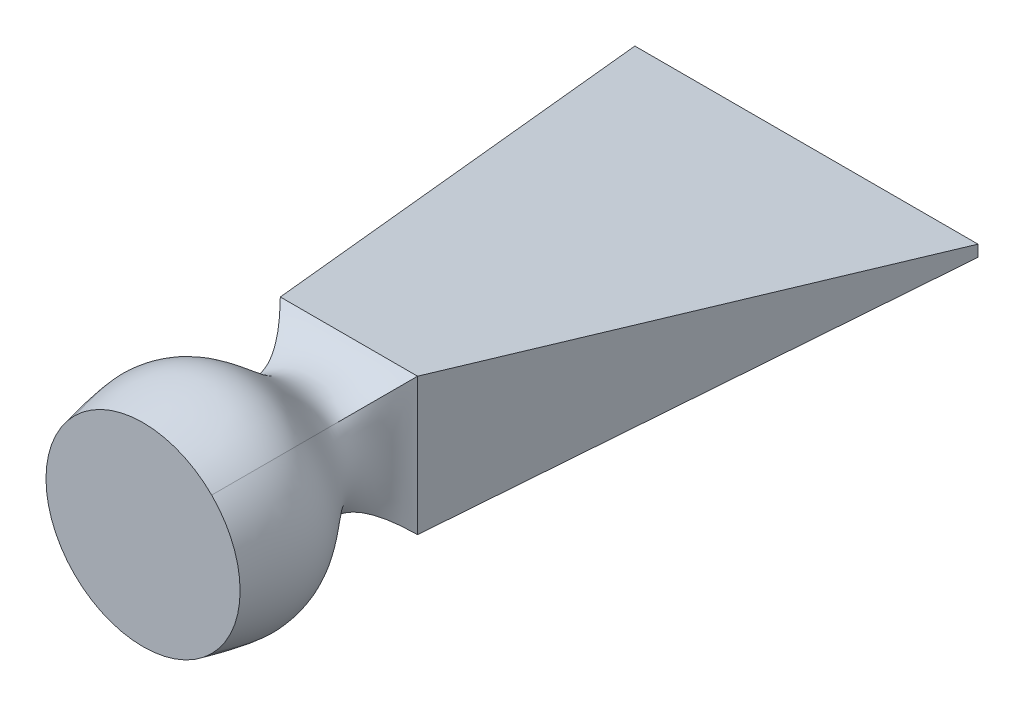
ISO-10303-21;
HEADER;
FILE_DESCRIPTION(('STEP AP214'),'2;1');
FILE_NAME('part.step','',(''),(''),'','','');
FILE_SCHEMA(('AUTOMOTIVE_DESIGN { 1 0 10303 214 1 1 1 1 }'));
ENDSEC;
DATA;
#1=APPLICATION_CONTEXT('core data for automotive mechanical design processes');
#2=APPLICATION_PROTOCOL_DEFINITION('international standard','automotive_design',2000,#1);
#3=PRODUCT_CONTEXT('',#1,'mechanical');
#4=PRODUCT('Part','Part','',(#3));
#5=PRODUCT_RELATED_PRODUCT_CATEGORY('part','',(#4));
#6=PRODUCT_DEFINITION_FORMATION('','',#4);
#7=PRODUCT_DEFINITION_CONTEXT('part definition',#1,'design');
#8=PRODUCT_DEFINITION('design','',#6,#7);
#9=PRODUCT_DEFINITION_SHAPE('','',#8);
#10=(LENGTH_UNIT() NAMED_UNIT(*) SI_UNIT(.MILLI.,.METRE.));
#11=(NAMED_UNIT(*) PLANE_ANGLE_UNIT() SI_UNIT($,.RADIAN.));
#12=(NAMED_UNIT(*) SI_UNIT($,.STERADIAN.) SOLID_ANGLE_UNIT());
#13=UNCERTAINTY_MEASURE_WITH_UNIT(LENGTH_MEASURE(1.E-05),#10,'distance_accuracy_value','');
#14=(GEOMETRIC_REPRESENTATION_CONTEXT(3) GLOBAL_UNCERTAINTY_ASSIGNED_CONTEXT((#13)) GLOBAL_UNIT_ASSIGNED_CONTEXT((#10,
#11,#12)) REPRESENTATION_CONTEXT('',''));
#15=CARTESIAN_POINT('',(0.,0.,0.));
#16=DIRECTION('',(0.,0.,1.));
#17=DIRECTION('',(1.,0.,0.));
#18=AXIS2_PLACEMENT_3D('',#15,#16,#17);
#19=CARTESIAN_POINT('',(0.,0.,90.));
#20=DIRECTION('',(0.,0.,1.));
#21=DIRECTION('',(1.,0.,0.));
#22=AXIS2_PLACEMENT_3D('',#19,#20,#21);
#23=PLANE('',#22);
#24=CARTESIAN_POINT('',(0.,0.,90.));
#25=DIRECTION('',(0.,0.,1.));
#26=DIRECTION('',(1.,0.,0.));
#27=AXIS2_PLACEMENT_3D('',#24,#25,#26);
#28=CIRCLE('',#27,42.4264068711929);
#29=CARTESIAN_POINT('',(-30.,30.,90.));
#30=VERTEX_POINT('',#29);
#31=CARTESIAN_POINT('',(-30.,-30.,90.));
#32=VERTEX_POINT('',#31);
#33=EDGE_CURVE('E114',#30,#32,#28,.T.);
#34=ORIENTED_EDGE('',*,*,#33,.T.);
#35=CARTESIAN_POINT('',(30.,-30.,90.));
#36=VERTEX_POINT('',#35);
#37=EDGE_CURVE('E106',#32,#36,#28,.T.);
#38=ORIENTED_EDGE('',*,*,#37,.T.);
#39=CARTESIAN_POINT('',(30.,30.,90.));
#40=VERTEX_POINT('',#39);
#41=EDGE_CURVE('E110',#36,#40,#28,.T.);
#42=ORIENTED_EDGE('',*,*,#41,.T.);
#43=EDGE_CURVE('E134',#40,#30,#28,.T.);
#44=ORIENTED_EDGE('',*,*,#43,.T.);
#45=EDGE_LOOP('',(#34,#38,#42,#44));
#46=FACE_BOUND('',#45,.T.);
#47=ADVANCED_FACE('F71',(#46),#23,.T.);
#48=CARTESIAN_POINT('',(30.,30.,0.));
#49=CARTESIAN_POINT('',(21.7851130197758,21.7851130197758,8.33333333333334));
#50=CARTESIAN_POINT('',(11.4480792780272,11.4480792780272,26.6842583231321));
#51=CARTESIAN_POINT('',(36.5877389212421,36.5877389212421,50.9567471285879));
#52=CARTESIAN_POINT('',(32.3581604097574,32.3581604097574,75.7725733783253));
#53=CARTESIAN_POINT('',(30.,30.,90.));
#54=CARTESIAN_POINT('',(10.,30.,0.));
#55=CARTESIAN_POINT('',(7.26170433992527,21.7851130197758,8.33333333333334));
#56=CARTESIAN_POINT('',(6.36969580298355,23.7303286113224,26.6842583231321));
#57=CARTESIAN_POINT('',(15.9903753094837,54.8377649087592,50.9567471285879));
#58=CARTESIAN_POINT('',(14.2286031722261,48.9156107074504,75.7725733783253));
#59=CARTESIAN_POINT('',(13.442549702307,46.557450297693,90.));
#60=CARTESIAN_POINT('',(-9.99999999999999,30.,0.));
#61=CARTESIAN_POINT('',(-7.26170433992526,21.7851130197758,8.33333333333334));
#62=CARTESIAN_POINT('',(-6.36969580298354,23.7303286113224,26.6842583231321));
#63=CARTESIAN_POINT('',(-15.9903753094837,54.8377649087592,50.9567471285879));
#64=CARTESIAN_POINT('',(-14.2286031722261,48.9156107074504,75.7725733783253));
#65=CARTESIAN_POINT('',(-13.442549702307,46.557450297693,90.));
#66=CARTESIAN_POINT('',(-30.,30.,0.));
#67=CARTESIAN_POINT('',(-21.7851130197758,21.7851130197758,8.33333333333334));
#68=CARTESIAN_POINT('',(-11.4480792780272,11.4480792780272,26.6842583231321));
#69=CARTESIAN_POINT('',(-36.5877389212421,36.5877389212421,50.9567471285879));
#70=CARTESIAN_POINT('',(-32.3581604097574,32.3581604097574,75.7725733783253));
#71=CARTESIAN_POINT('',(-30.,30.,90.));
#72=B_SPLINE_SURFACE_WITH_KNOTS('',3,3,((#48,#49,#50,#51,#52,#53),(#54,#55,#56,#57,#58,#59),
(#60,#61,#62,#63,#64,#65),(#66,#67,#68,#69,#70,#71)),.UNSPECIFIED.,.F.,.F.,.F.,(4,4),(4,1,1,4),
(0.,1.),(0.,0.284226887704337,0.593739185555325,1.),.UNSPECIFIED.);
#73=DIRECTION('',(-1.,0.,0.));
#74=VECTOR('',#73,1.);
#75=CARTESIAN_POINT('',(-30.,30.,0.));
#76=LINE('',#75,#74);
#77=CARTESIAN_POINT('',(30.,30.,0.));
#78=VERTEX_POINT('',#77);
#79=CARTESIAN_POINT('',(-30.,30.,0.));
#80=VERTEX_POINT('',#79);
#81=EDGE_CURVE('E319',#78,#80,#76,.T.);
#82=CARTESIAN_POINT('',(-30.,30.,0.));
#83=CARTESIAN_POINT('',(-21.7851130197758,21.7851130197758,8.33333333333334));
#84=CARTESIAN_POINT('',(-11.4480792780272,11.4480792780272,26.6842583231321));
#85=CARTESIAN_POINT('',(-36.5877389212421,36.5877389212421,50.9567471285879));
#86=CARTESIAN_POINT('',(-32.3581604097574,32.3581604097574,75.7725733783253));
#87=CARTESIAN_POINT('',(-30.,30.,90.));
#88=B_SPLINE_CURVE_WITH_KNOTS('',3,(#82,#83,#84,#85,#86,#87),.UNSPECIFIED.,.F.,.F.,(4,1,1,4),
(0.,0.284226887704337,0.593739185555325,1.),.UNSPECIFIED.);
#89=EDGE_CURVE('E156',#80,#30,#88,.T.);
#90=CARTESIAN_POINT('',(30.,30.,0.));
#91=CARTESIAN_POINT('',(21.7851130197758,21.7851130197758,8.33333333333334));
#92=CARTESIAN_POINT('',(11.4480792780272,11.4480792780272,26.6842583231321));
#93=CARTESIAN_POINT('',(36.5877389212421,36.5877389212421,50.9567471285879));
#94=CARTESIAN_POINT('',(32.3581604097574,32.3581604097574,75.7725733783253));
#95=CARTESIAN_POINT('',(30.,30.,90.));
#96=B_SPLINE_CURVE_WITH_KNOTS('',3,(#90,#91,#92,#93,#94,#95),.UNSPECIFIED.,.F.,.F.,(4,1,1,4),
(0.,0.284226887704337,0.593739185555325,1.),.UNSPECIFIED.);
#97=EDGE_CURVE('E133',#40,#78,#96,.F.);
#98=ORIENTED_EDGE('',*,*,#81,.T.);
#99=ORIENTED_EDGE('',*,*,#89,.T.);
#100=ORIENTED_EDGE('',*,*,#43,.F.);
#101=ORIENTED_EDGE('',*,*,#97,.T.);
#102=EDGE_LOOP('',(#98,#99,#100,#101));
#103=FACE_BOUND('',#102,.T.);
#104=ADVANCED_FACE('F179',(#103),#72,.T.);
#105=CARTESIAN_POINT('',(-30.,30.,0.));
#106=CARTESIAN_POINT('',(-21.7851130197758,21.7851130197758,8.33333333333334));
#107=CARTESIAN_POINT('',(-11.4480792780272,11.4480792780272,26.6842583231321));
#108=CARTESIAN_POINT('',(-36.5877389212421,36.5877389212421,50.9567471285879));
#109=CARTESIAN_POINT('',(-32.3581604097574,32.3581604097574,75.7725733783253));
#110=CARTESIAN_POINT('',(-30.,30.,90.));
#111=CARTESIAN_POINT('',(-30.,10.,0.));
#112=CARTESIAN_POINT('',(-21.7851130197758,7.26170433992526,8.33333333333334));
#113=CARTESIAN_POINT('',(-23.7303286113224,6.36969580298355,26.6842583231321));
#114=CARTESIAN_POINT('',(-54.8377649087592,15.9903753094837,50.9567471285879));
#115=CARTESIAN_POINT('',(-48.9156107074504,14.2286031722261,75.7725733783253));
#116=CARTESIAN_POINT('',(-46.557450297693,13.442549702307,90.));
#117=CARTESIAN_POINT('',(-30.,-10.,0.));
#118=CARTESIAN_POINT('',(-21.7851130197758,-7.26170433992526,8.33333333333334));
#119=CARTESIAN_POINT('',(-23.7303286113224,-6.36969580298354,26.6842583231321));
#120=CARTESIAN_POINT('',(-54.8377649087592,-15.9903753094837,50.9567471285879));
#121=CARTESIAN_POINT('',(-48.9156107074504,-14.2286031722261,75.7725733783253));
#122=CARTESIAN_POINT('',(-46.557450297693,-13.442549702307,90.));
#123=CARTESIAN_POINT('',(-30.,-30.,0.));
#124=CARTESIAN_POINT('',(-21.7851130197758,-21.7851130197758,8.33333333333334));
#125=CARTESIAN_POINT('',(-11.4480792780272,-11.4480792780272,26.6842583231321));
#126=CARTESIAN_POINT('',(-36.5877389212421,-36.5877389212421,50.9567471285879));
#127=CARTESIAN_POINT('',(-32.3581604097574,-32.3581604097574,75.7725733783253));
#128=CARTESIAN_POINT('',(-30.,-30.,90.));
#129=B_SPLINE_SURFACE_WITH_KNOTS('',3,3,((#105,#106,#107,#108,#109,#110),(#111,#112,#113,#114,
#115,#116),(#117,#118,#119,#120,#121,#122),(#123,#124,#125,#126,#127,#128)),.UNSPECIFIED.,.F.,
.F.,.F.,(4,4),(4,1,1,4),(0.,1.),(0.,0.284226887704337,0.593739185555325,1.),.UNSPECIFIED.);
#130=DIRECTION('',(0.,-1.,0.));
#131=VECTOR('',#130,1.);
#132=CARTESIAN_POINT('',(-30.,-30.,0.));
#133=LINE('',#132,#131);
#134=CARTESIAN_POINT('',(-30.,-30.,0.));
#135=VERTEX_POINT('',#134);
#136=EDGE_CURVE('E81',#80,#135,#133,.T.);
#137=CARTESIAN_POINT('',(-30.,-30.,0.));
#138=CARTESIAN_POINT('',(-21.7851130197758,-21.7851130197758,8.33333333333334));
#139=CARTESIAN_POINT('',(-11.4480792780272,-11.4480792780272,26.6842583231321));
#140=CARTESIAN_POINT('',(-36.5877389212421,-36.5877389212421,50.9567471285879));
#141=CARTESIAN_POINT('',(-32.3581604097574,-32.3581604097574,75.7725733783253));
#142=CARTESIAN_POINT('',(-30.,-30.,90.));
#143=B_SPLINE_CURVE_WITH_KNOTS('',3,(#137,#138,#139,#140,#141,#142),.UNSPECIFIED.,.F.,.F.,(4,1,
1,4),(0.,0.284226887704337,0.593739185555325,1.),.UNSPECIFIED.);
#144=EDGE_CURVE('E140',#135,#32,#143,.T.);
#145=ORIENTED_EDGE('',*,*,#136,.T.);
#146=ORIENTED_EDGE('',*,*,#144,.T.);
#147=ORIENTED_EDGE('',*,*,#33,.F.);
#148=ORIENTED_EDGE('',*,*,#89,.F.);
#149=EDGE_LOOP('',(#145,#146,#147,#148));
#150=FACE_BOUND('',#149,.T.);
#151=ADVANCED_FACE('F191',(#150),#129,.T.);
#152=CARTESIAN_POINT('',(30.,-30.,0.));
#153=CARTESIAN_POINT('',(21.7851130197758,-21.7851130197758,8.33333333333334));
#154=CARTESIAN_POINT('',(11.4480792780272,-11.4480792780272,26.6842583231321));
#155=CARTESIAN_POINT('',(36.5877389212421,-36.5877389212421,50.9567471285879));
#156=CARTESIAN_POINT('',(32.3581604097574,-32.3581604097574,75.7725733783253));
#157=CARTESIAN_POINT('',(30.,-30.,90.));
#158=CARTESIAN_POINT('',(30.,-10.,0.));
#159=CARTESIAN_POINT('',(21.7851130197758,-7.26170433992527,8.33333333333334));
#160=CARTESIAN_POINT('',(23.7303286113224,-6.36969580298356,26.6842583231321));
#161=CARTESIAN_POINT('',(54.8377649087593,-15.9903753094837,50.9567471285879));
#162=CARTESIAN_POINT('',(48.9156107074504,-14.2286031722261,75.7725733783253));
#163=CARTESIAN_POINT('',(46.557450297693,-13.442549702307,90.));
#164=CARTESIAN_POINT('',(30.,10.,0.));
#165=CARTESIAN_POINT('',(21.7851130197758,7.26170433992526,8.33333333333334));
#166=CARTESIAN_POINT('',(23.7303286113224,6.36969580298354,26.6842583231321));
#167=CARTESIAN_POINT('',(54.8377649087593,15.9903753094837,50.9567471285879));
#168=CARTESIAN_POINT('',(48.9156107074504,14.2286031722261,75.7725733783253));
#169=CARTESIAN_POINT('',(46.557450297693,13.442549702307,90.));
#170=CARTESIAN_POINT('',(30.,30.,0.));
#171=CARTESIAN_POINT('',(21.7851130197758,21.7851130197758,8.33333333333334));
#172=CARTESIAN_POINT('',(11.4480792780272,11.4480792780272,26.6842583231321));
#173=CARTESIAN_POINT('',(36.5877389212422,36.5877389212421,50.9567471285879));
#174=CARTESIAN_POINT('',(32.3581604097574,32.3581604097574,75.7725733783253));
#175=CARTESIAN_POINT('',(30.,30.,90.));
#176=B_SPLINE_SURFACE_WITH_KNOTS('',3,3,((#152,#153,#154,#155,#156,#157),(#158,#159,#160,#161,
#162,#163),(#164,#165,#166,#167,#168,#169),(#170,#171,#172,#173,#174,#175)),.UNSPECIFIED.,.F.,
.F.,.F.,(4,4),(4,1,1,4),(0.,1.),(0.,0.284226887704337,0.593739185555325,1.),.UNSPECIFIED.);
#177=DIRECTION('',(0.,1.,0.));
#178=VECTOR('',#177,1.);
#179=CARTESIAN_POINT('',(30.,-30.,0.));
#180=LINE('',#179,#178);
#181=CARTESIAN_POINT('',(30.,-30.,0.));
#182=VERTEX_POINT('',#181);
#183=EDGE_CURVE('E165',#182,#78,#180,.T.);
#184=CARTESIAN_POINT('',(30.,-30.,0.));
#185=CARTESIAN_POINT('',(21.7851130197758,-21.7851130197758,8.33333333333334));
#186=CARTESIAN_POINT('',(11.4480792780272,-11.4480792780272,26.6842583231321));
#187=CARTESIAN_POINT('',(36.5877389212421,-36.5877389212421,50.9567471285879));
#188=CARTESIAN_POINT('',(32.3581604097574,-32.3581604097574,75.7725733783253));
#189=CARTESIAN_POINT('',(30.,-30.,90.));
#190=B_SPLINE_CURVE_WITH_KNOTS('',3,(#184,#185,#186,#187,#188,#189),.UNSPECIFIED.,.F.,.F.,(4,1,
1,4),(0.,0.284226887704337,0.593739185555325,1.),.UNSPECIFIED.);
#191=EDGE_CURVE('E131',#182,#36,#190,.T.);
#192=ORIENTED_EDGE('',*,*,#183,.T.);
#193=ORIENTED_EDGE('',*,*,#97,.F.);
#194=ORIENTED_EDGE('',*,*,#41,.F.);
#195=ORIENTED_EDGE('',*,*,#191,.F.);
#196=EDGE_LOOP('',(#192,#193,#194,#195));
#197=FACE_BOUND('',#196,.T.);
#198=ADVANCED_FACE('F129',(#197),#176,.T.);
#199=CARTESIAN_POINT('',(-30.,-30.,0.));
#200=CARTESIAN_POINT('',(-21.7851130197758,-21.7851130197758,8.33333333333334));
#201=CARTESIAN_POINT('',(-11.4480792780272,-11.4480792780272,26.6842583231321));
#202=CARTESIAN_POINT('',(-36.5877389212421,-36.5877389212421,50.9567471285879));
#203=CARTESIAN_POINT('',(-32.3581604097574,-32.3581604097574,75.7725733783253));
#204=CARTESIAN_POINT('',(-30.,-30.,90.));
#205=CARTESIAN_POINT('',(-9.99999999999999,-30.,0.));
#206=CARTESIAN_POINT('',(-7.26170433992526,-21.7851130197758,8.33333333333334));
#207=CARTESIAN_POINT('',(-6.36969580298355,-23.7303286113224,26.6842583231321));
#208=CARTESIAN_POINT('',(-15.9903753094837,-54.8377649087593,50.9567471285879));
#209=CARTESIAN_POINT('',(-14.2286031722261,-48.9156107074504,75.7725733783253));
#210=CARTESIAN_POINT('',(-13.442549702307,-46.557450297693,90.));
#211=CARTESIAN_POINT('',(10.,-30.,0.));
#212=CARTESIAN_POINT('',(7.26170433992527,-21.7851130197758,8.33333333333334));
#213=CARTESIAN_POINT('',(6.36969580298354,-23.7303286113224,26.6842583231321));
#214=CARTESIAN_POINT('',(15.9903753094837,-54.8377649087593,50.9567471285879));
#215=CARTESIAN_POINT('',(14.2286031722261,-48.9156107074504,75.7725733783253));
#216=CARTESIAN_POINT('',(13.442549702307,-46.557450297693,90.));
#217=CARTESIAN_POINT('',(30.,-30.,0.));
#218=CARTESIAN_POINT('',(21.7851130197758,-21.7851130197758,8.33333333333334));
#219=CARTESIAN_POINT('',(11.4480792780272,-11.4480792780272,26.6842583231321));
#220=CARTESIAN_POINT('',(36.5877389212421,-36.5877389212421,50.9567471285879));
#221=CARTESIAN_POINT('',(32.3581604097574,-32.3581604097574,75.7725733783253));
#222=CARTESIAN_POINT('',(30.,-30.,90.));
#223=B_SPLINE_SURFACE_WITH_KNOTS('',3,3,((#199,#200,#201,#202,#203,#204),(#205,#206,#207,#208,
#209,#210),(#211,#212,#213,#214,#215,#216),(#217,#218,#219,#220,#221,#222)),.UNSPECIFIED.,.F.,
.F.,.F.,(4,4),(4,1,1,4),(0.,1.),(0.,0.284226887704337,0.593739185555325,1.),.UNSPECIFIED.);
#224=DIRECTION('',(1.,0.,0.));
#225=VECTOR('',#224,1.);
#226=CARTESIAN_POINT('',(-30.,-30.,0.));
#227=LINE('',#226,#225);
#228=EDGE_CURVE('E12',#135,#182,#227,.T.);
#229=ORIENTED_EDGE('',*,*,#228,.T.);
#230=ORIENTED_EDGE('',*,*,#191,.T.);
#231=ORIENTED_EDGE('',*,*,#37,.F.);
#232=ORIENTED_EDGE('',*,*,#144,.F.);
#233=EDGE_LOOP('',(#229,#230,#231,#232));
#234=FACE_BOUND('',#233,.T.);
#235=ADVANCED_FACE('F138',(#234),#223,.T.);
#236=CARTESIAN_POINT('',(0.,0.,-200.));
#237=DIRECTION('',(0.,0.,1.));
#238=DIRECTION('',(1.,0.,0.));
#239=AXIS2_PLACEMENT_3D('',#236,#237,#238);
#240=PLANE('',#239);
#241=DIRECTION('',(0.,-1.,0.));
#242=VECTOR('',#241,1.);
#243=CARTESIAN_POINT('',(-75.,-2.50000000000001,-200.));
#244=LINE('',#243,#242);
#245=CARTESIAN_POINT('',(-75.,2.49999999999999,-200.));
#246=VERTEX_POINT('',#245);
#247=CARTESIAN_POINT('',(-75.,-2.50000000000001,-200.));
#248=VERTEX_POINT('',#247);
#249=EDGE_CURVE('E331',#246,#248,#244,.T.);
#250=ORIENTED_EDGE('',*,*,#249,.F.);
#251=DIRECTION('',(-1.,0.,0.));
#252=VECTOR('',#251,1.);
#253=CARTESIAN_POINT('',(75.,2.50000000000001,-200.));
#254=LINE('',#253,#252);
#255=CARTESIAN_POINT('',(75.,2.50000000000001,-200.));
#256=VERTEX_POINT('',#255);
#257=EDGE_CURVE('E315',#256,#246,#254,.T.);
#258=ORIENTED_EDGE('',*,*,#257,.F.);
#259=DIRECTION('',(0.,1.,0.));
#260=VECTOR('',#259,1.);
#261=CARTESIAN_POINT('',(75.,-2.49999999999999,-200.));
#262=LINE('',#261,#260);
#263=CARTESIAN_POINT('',(75.,-2.49999999999999,-200.));
#264=VERTEX_POINT('',#263);
#265=EDGE_CURVE('E328',#264,#256,#262,.T.);
#266=ORIENTED_EDGE('',*,*,#265,.F.);
#267=DIRECTION('',(1.,0.,0.));
#268=VECTOR('',#267,1.);
#269=CARTESIAN_POINT('',(75.,-2.49999999999999,-200.));
#270=LINE('',#269,#268);
#271=EDGE_CURVE('E366',#248,#264,#270,.T.);
#272=ORIENTED_EDGE('',*,*,#271,.F.);
#273=EDGE_LOOP('',(#250,#258,#266,#272));
#274=FACE_BOUND('',#273,.T.);
#275=ADVANCED_FACE('F234',(#274),#240,.F.);
#276=CARTESIAN_POINT('',(0.,-29.4433369115166,-4.04845882533354));
#277=DIRECTION('',(0.,-0.990678839845296,-0.136218340478728));
#278=DIRECTION('',(0.,0.136218340478728,-0.990678839845296));
#279=AXIS2_PLACEMENT_3D('',#276,#277,#278);
#280=PLANE('',#279);
#281=DIRECTION('',(-0.217563370783763,0.132955393256744,-0.966948314594504));
#282=VECTOR('',#281,1.);
#283=CARTESIAN_POINT('',(-30.,-30.,0.));
#284=LINE('',#283,#282);
#285=EDGE_CURVE('E380',#135,#248,#284,.T.);
#286=ORIENTED_EDGE('',*,*,#285,.T.);
#287=ORIENTED_EDGE('',*,*,#271,.T.);
#288=DIRECTION('',(0.217563370783763,0.132955393256744,-0.966948314594504));
#289=VECTOR('',#288,1.);
#290=CARTESIAN_POINT('',(30.,-30.,0.));
#291=LINE('',#290,#289);
#292=EDGE_CURVE('E382',#182,#264,#291,.T.);
#293=ORIENTED_EDGE('',*,*,#292,.F.);
#294=ORIENTED_EDGE('',*,*,#228,.F.);
#295=EDGE_LOOP('',(#286,#287,#293,#294));
#296=FACE_BOUND('',#295,.T.);
#297=ADVANCED_FACE('F244',(#296),#280,.T.);
#298=CARTESIAN_POINT('',(28.5544318857823,0.,6.42474717430101));
#299=DIRECTION('',(0.975609756097561,0.,0.219512195121951));
#300=DIRECTION('',(0.219512195121951,0.,-0.975609756097561));
#301=AXIS2_PLACEMENT_3D('',#298,#299,#300);
#302=PLANE('',#301);
#303=ORIENTED_EDGE('',*,*,#292,.T.);
#304=ORIENTED_EDGE('',*,*,#265,.T.);
#305=DIRECTION('',(0.217563370783763,-0.132955393256744,-0.966948314594504));
#306=VECTOR('',#305,1.);
#307=CARTESIAN_POINT('',(30.,30.,0.));
#308=LINE('',#307,#306);
#309=EDGE_CURVE('E89',#78,#256,#308,.T.);
#310=ORIENTED_EDGE('',*,*,#309,.F.);
#311=ORIENTED_EDGE('',*,*,#183,.F.);
#312=EDGE_LOOP('',(#303,#304,#310,#311));
#313=FACE_BOUND('',#312,.T.);
#314=ADVANCED_FACE('F281',(#313),#302,.T.);
#315=CARTESIAN_POINT('',(-28.5544318857823,0.,6.42474717430101));
#316=DIRECTION('',(-0.975609756097561,0.,0.219512195121951));
#317=DIRECTION('',(0.219512195121951,0.,0.975609756097561));
#318=AXIS2_PLACEMENT_3D('',#315,#316,#317);
#319=PLANE('',#318);
#320=DIRECTION('',(-0.217563370783763,-0.132955393256744,-0.966948314594504));
#321=VECTOR('',#320,1.);
#322=CARTESIAN_POINT('',(-30.,30.,0.));
#323=LINE('',#322,#321);
#324=EDGE_CURVE('E321',#80,#246,#323,.T.);
#325=ORIENTED_EDGE('',*,*,#324,.T.);
#326=ORIENTED_EDGE('',*,*,#249,.T.);
#327=ORIENTED_EDGE('',*,*,#285,.F.);
#328=ORIENTED_EDGE('',*,*,#136,.F.);
#329=EDGE_LOOP('',(#325,#326,#327,#328));
#330=FACE_BOUND('',#329,.T.);
#331=ADVANCED_FACE('F291',(#330),#319,.T.);
#332=CARTESIAN_POINT('',(0.,29.4433369115166,-4.04845882533354));
#333=DIRECTION('',(0.,0.990678839845296,-0.136218340478728));
#334=DIRECTION('',(0.,0.136218340478728,0.990678839845296));
#335=AXIS2_PLACEMENT_3D('',#332,#333,#334);
#336=PLANE('',#335);
#337=ORIENTED_EDGE('',*,*,#309,.T.);
#338=ORIENTED_EDGE('',*,*,#257,.T.);
#339=ORIENTED_EDGE('',*,*,#324,.F.);
#340=ORIENTED_EDGE('',*,*,#81,.F.);
#341=EDGE_LOOP('',(#337,#338,#339,#340));
#342=FACE_BOUND('',#341,.T.);
#343=ADVANCED_FACE('F192',(#342),#336,.T.);
#344=CLOSED_SHELL('',(#47,#104,#151,#198,#235,#275,#297,#314,#331,#343));
#345=MANIFOLD_SOLID_BREP('B2',#344);
#346=ADVANCED_BREP_SHAPE_REPRESENTATION('',(#18,#345),#14);
#347=SHAPE_DEFINITION_REPRESENTATION(#9,#346);
ENDSEC;
END-ISO-10303-21;
